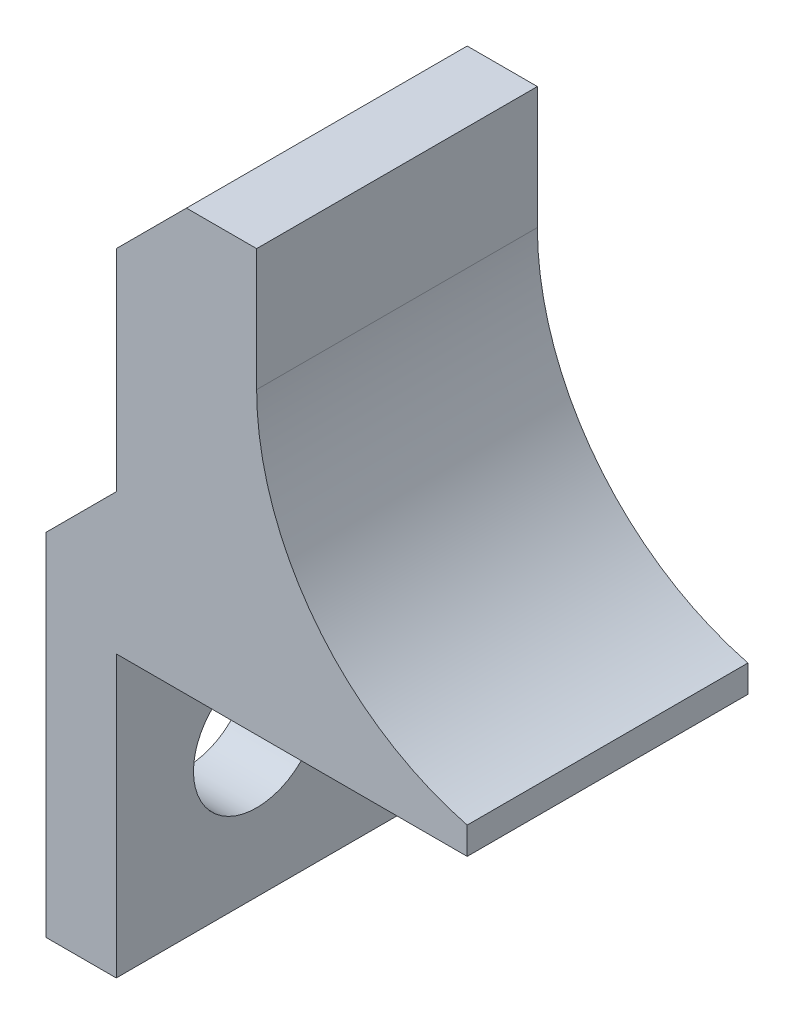
ISO-10303-21;
HEADER;
FILE_DESCRIPTION(('STEP AP214'),'2;1');
FILE_NAME('part.step','',(''),(''),'','','');
FILE_SCHEMA(('AUTOMOTIVE_DESIGN { 1 0 10303 214 1 1 1 1 }'));
ENDSEC;
DATA;
#1=APPLICATION_CONTEXT('core data for automotive mechanical design processes');
#2=APPLICATION_PROTOCOL_DEFINITION('international standard','automotive_design',2000,#1);
#3=PRODUCT_CONTEXT('',#1,'mechanical');
#4=PRODUCT('Part','Part','',(#3));
#5=PRODUCT_RELATED_PRODUCT_CATEGORY('part','',(#4));
#6=PRODUCT_DEFINITION_FORMATION('','',#4);
#7=PRODUCT_DEFINITION_CONTEXT('part definition',#1,'design');
#8=PRODUCT_DEFINITION('design','',#6,#7);
#9=PRODUCT_DEFINITION_SHAPE('','',#8);
#10=(LENGTH_UNIT() NAMED_UNIT(*) SI_UNIT(.MILLI.,.METRE.));
#11=(NAMED_UNIT(*) PLANE_ANGLE_UNIT() SI_UNIT($,.RADIAN.));
#12=(NAMED_UNIT(*) SI_UNIT($,.STERADIAN.) SOLID_ANGLE_UNIT());
#13=UNCERTAINTY_MEASURE_WITH_UNIT(LENGTH_MEASURE(1.E-05),#10,'distance_accuracy_value','');
#14=(GEOMETRIC_REPRESENTATION_CONTEXT(3) GLOBAL_UNCERTAINTY_ASSIGNED_CONTEXT((#13)) GLOBAL_UNIT_ASSIGNED_CONTEXT((#10,
#11,#12)) REPRESENTATION_CONTEXT('',''));
#15=CARTESIAN_POINT('',(0.,0.,0.));
#16=DIRECTION('',(0.,0.,1.));
#17=DIRECTION('',(1.,0.,0.));
#18=AXIS2_PLACEMENT_3D('',#15,#16,#17);
#19=CARTESIAN_POINT('',(0.,0.,20.));
#20=DIRECTION('',(-1.,0.,0.));
#21=DIRECTION('',(0.,0.,1.));
#22=AXIS2_PLACEMENT_3D('',#19,#20,#21);
#23=PLANE('',#22);
#24=CARTESIAN_POINT('',(0.,-10.,10.));
#25=DIRECTION('',(-1.,0.,0.));
#26=DIRECTION('',(0.,0.,1.));
#27=AXIS2_PLACEMENT_3D('',#24,#25,#26);
#28=CIRCLE('',#27,4.5);
#29=CARTESIAN_POINT('',(0.,-10.,14.5));
#30=VERTEX_POINT('',#29);
#31=EDGE_CURVE('E214',#30,#30,#28,.T.);
#32=ORIENTED_EDGE('',*,*,#31,.T.);
#33=EDGE_LOOP('',(#32));
#34=FACE_BOUND('',#33,.T.);
#35=DIRECTION('',(0.,1.,0.));
#36=VECTOR('',#35,1.);
#37=CARTESIAN_POINT('',(0.,0.,0.));
#38=LINE('',#37,#36);
#39=CARTESIAN_POINT('',(0.,-20.,0.));
#40=VERTEX_POINT('',#39);
#41=CARTESIAN_POINT('',(0.,0.,0.));
#42=VERTEX_POINT('',#41);
#43=EDGE_CURVE('E145',#40,#42,#38,.T.);
#44=ORIENTED_EDGE('',*,*,#43,.T.);
#45=DIRECTION('',(0.,0.,-1.));
#46=VECTOR('',#45,1.);
#47=CARTESIAN_POINT('',(0.,0.,20.));
#48=LINE('',#47,#46);
#49=CARTESIAN_POINT('',(0.,0.,20.));
#50=VERTEX_POINT('',#49);
#51=EDGE_CURVE('E126',#50,#42,#48,.T.);
#52=ORIENTED_EDGE('',*,*,#51,.F.);
#53=DIRECTION('',(0.,1.,0.));
#54=VECTOR('',#53,1.);
#55=CARTESIAN_POINT('',(0.,0.,20.));
#56=LINE('',#55,#54);
#57=CARTESIAN_POINT('',(0.,-20.,20.));
#58=VERTEX_POINT('',#57);
#59=EDGE_CURVE('E133',#58,#50,#56,.T.);
#60=ORIENTED_EDGE('',*,*,#59,.F.);
#61=DIRECTION('',(0.,0.,-1.));
#62=VECTOR('',#61,1.);
#63=CARTESIAN_POINT('',(0.,-20.,20.));
#64=LINE('',#63,#62);
#65=EDGE_CURVE('E182',#58,#40,#64,.T.);
#66=ORIENTED_EDGE('',*,*,#65,.T.);
#67=EDGE_LOOP('',(#44,#52,#60,#66));
#68=FACE_BOUND('',#67,.T.);
#69=ADVANCED_FACE('F38',(#34,#68),#23,.F.);
#70=CARTESIAN_POINT('',(6.25,0.,20.));
#71=DIRECTION('',(0.,1.,0.));
#72=DIRECTION('',(0.,0.,1.));
#73=AXIS2_PLACEMENT_3D('',#70,#71,#72);
#74=PLANE('',#73);
#75=DIRECTION('',(1.,0.,0.));
#76=VECTOR('',#75,1.);
#77=CARTESIAN_POINT('',(6.25,0.,0.));
#78=LINE('',#77,#76);
#79=CARTESIAN_POINT('',(25.,0.,0.));
#80=VERTEX_POINT('',#79);
#81=EDGE_CURVE('E209',#42,#80,#78,.T.);
#82=ORIENTED_EDGE('',*,*,#81,.T.);
#83=DIRECTION('',(0.,0.,-1.));
#84=VECTOR('',#83,1.);
#85=CARTESIAN_POINT('',(25.,0.,20.));
#86=LINE('',#85,#84);
#87=CARTESIAN_POINT('',(25.,0.,20.));
#88=VERTEX_POINT('',#87);
#89=EDGE_CURVE('E129',#88,#80,#86,.T.);
#90=ORIENTED_EDGE('',*,*,#89,.F.);
#91=DIRECTION('',(1.,0.,0.));
#92=VECTOR('',#91,1.);
#93=CARTESIAN_POINT('',(0.,0.,20.));
#94=LINE('',#93,#92);
#95=EDGE_CURVE('E122',#50,#88,#94,.T.);
#96=ORIENTED_EDGE('',*,*,#95,.F.);
#97=ORIENTED_EDGE('',*,*,#51,.T.);
#98=EDGE_LOOP('',(#82,#90,#96,#97));
#99=FACE_BOUND('',#98,.T.);
#100=ADVANCED_FACE('F124',(#99),#74,.F.);
#101=CARTESIAN_POINT('',(25.,0.,20.));
#102=DIRECTION('',(-1.,0.,0.));
#103=DIRECTION('',(0.,0.,1.));
#104=AXIS2_PLACEMENT_3D('',#101,#102,#103);
#105=PLANE('',#104);
#106=DIRECTION('',(0.,1.,0.));
#107=VECTOR('',#106,1.);
#108=CARTESIAN_POINT('',(25.,0.,0.));
#109=LINE('',#108,#107);
#110=CARTESIAN_POINT('',(25.,1.93508326896292,0.));
#111=VERTEX_POINT('',#110);
#112=EDGE_CURVE('E207',#80,#111,#109,.T.);
#113=ORIENTED_EDGE('',*,*,#112,.T.);
#114=DIRECTION('',(0.,0.,-1.));
#115=VECTOR('',#114,1.);
#116=CARTESIAN_POINT('',(25.,1.93508326896292,20.));
#117=LINE('',#116,#115);
#118=CARTESIAN_POINT('',(25.,1.93508326896292,20.));
#119=VERTEX_POINT('',#118);
#120=EDGE_CURVE('E151',#119,#111,#117,.T.);
#121=ORIENTED_EDGE('',*,*,#120,.F.);
#122=DIRECTION('',(0.,1.,0.));
#123=VECTOR('',#122,1.);
#124=CARTESIAN_POINT('',(25.,0.,20.));
#125=LINE('',#124,#123);
#126=EDGE_CURVE('E132',#88,#119,#125,.T.);
#127=ORIENTED_EDGE('',*,*,#126,.F.);
#128=ORIENTED_EDGE('',*,*,#89,.T.);
#129=EDGE_LOOP('',(#113,#121,#127,#128));
#130=FACE_BOUND('',#129,.T.);
#131=ADVANCED_FACE('F244',(#130),#105,.F.);
#132=CARTESIAN_POINT('',(30.,21.3,20.));
#133=DIRECTION('',(0.,0.,-1.));
#134=DIRECTION('',(-1.,0.,0.));
#135=AXIS2_PLACEMENT_3D('',#132,#133,#134);
#136=CYLINDRICAL_SURFACE('',#135,20.);
#137=CARTESIAN_POINT('',(30.,21.3,0.));
#138=DIRECTION('',(0.,0.,-1.));
#139=DIRECTION('',(1.,0.,0.));
#140=AXIS2_PLACEMENT_3D('',#137,#138,#139);
#141=CIRCLE('',#140,20.);
#142=CARTESIAN_POINT('',(9.99999999999999,21.3,0.));
#143=VERTEX_POINT('',#142);
#144=EDGE_CURVE('E202',#111,#143,#141,.T.);
#145=ORIENTED_EDGE('',*,*,#144,.T.);
#146=DIRECTION('',(0.,0.,-1.));
#147=VECTOR('',#146,1.);
#148=CARTESIAN_POINT('',(9.99999999999999,21.3,20.));
#149=LINE('',#148,#147);
#150=CARTESIAN_POINT('',(9.99999999999999,21.3,20.));
#151=VERTEX_POINT('',#150);
#152=EDGE_CURVE('E193',#151,#143,#149,.T.);
#153=ORIENTED_EDGE('',*,*,#152,.F.);
#154=CARTESIAN_POINT('',(30.,21.3,20.));
#155=DIRECTION('',(0.,0.,-1.));
#156=DIRECTION('',(1.,0.,0.));
#157=AXIS2_PLACEMENT_3D('',#154,#155,#156);
#158=CIRCLE('',#157,20.);
#159=EDGE_CURVE('E203',#119,#151,#158,.T.);
#160=ORIENTED_EDGE('',*,*,#159,.F.);
#161=ORIENTED_EDGE('',*,*,#120,.T.);
#162=EDGE_LOOP('',(#145,#153,#160,#161));
#163=FACE_BOUND('',#162,.T.);
#164=ADVANCED_FACE('F200',(#163),#136,.F.);
#165=CARTESIAN_POINT('',(9.99999999999999,30.,20.));
#166=DIRECTION('',(-1.,0.,0.));
#167=DIRECTION('',(0.,0.,1.));
#168=AXIS2_PLACEMENT_3D('',#165,#166,#167);
#169=PLANE('',#168);
#170=DIRECTION('',(0.,1.,0.));
#171=VECTOR('',#170,1.);
#172=CARTESIAN_POINT('',(9.99999999999999,30.,0.));
#173=LINE('',#172,#171);
#174=CARTESIAN_POINT('',(9.99999999999999,30.,0.));
#175=VERTEX_POINT('',#174);
#176=EDGE_CURVE('E177',#143,#175,#173,.T.);
#177=ORIENTED_EDGE('',*,*,#176,.T.);
#178=DIRECTION('',(0.,0.,-1.));
#179=VECTOR('',#178,1.);
#180=CARTESIAN_POINT('',(9.99999999999999,30.,20.));
#181=LINE('',#180,#179);
#182=CARTESIAN_POINT('',(9.99999999999999,30.,20.));
#183=VERTEX_POINT('',#182);
#184=EDGE_CURVE('E190',#183,#175,#181,.T.);
#185=ORIENTED_EDGE('',*,*,#184,.F.);
#186=DIRECTION('',(0.,1.,0.));
#187=VECTOR('',#186,1.);
#188=CARTESIAN_POINT('',(9.99999999999999,30.,20.));
#189=LINE('',#188,#187);
#190=EDGE_CURVE('E221',#151,#183,#189,.T.);
#191=ORIENTED_EDGE('',*,*,#190,.F.);
#192=ORIENTED_EDGE('',*,*,#152,.T.);
#193=EDGE_LOOP('',(#177,#185,#191,#192));
#194=FACE_BOUND('',#193,.T.);
#195=ADVANCED_FACE('F248',(#194),#169,.F.);
#196=CARTESIAN_POINT('',(0.,30.,20.));
#197=DIRECTION('',(0.,-1.,0.));
#198=DIRECTION('',(0.,0.,-1.));
#199=AXIS2_PLACEMENT_3D('',#196,#197,#198);
#200=PLANE('',#199);
#201=DIRECTION('',(-1.,0.,0.));
#202=VECTOR('',#201,1.);
#203=CARTESIAN_POINT('',(0.,30.,0.));
#204=LINE('',#203,#202);
#205=CARTESIAN_POINT('',(5.00000000000001,30.,0.));
#206=VERTEX_POINT('',#205);
#207=EDGE_CURVE('E174',#175,#206,#204,.T.);
#208=ORIENTED_EDGE('',*,*,#207,.T.);
#209=DIRECTION('',(0.,0.,1.));
#210=VECTOR('',#209,1.);
#211=CARTESIAN_POINT('',(5.00000000000001,30.,20.));
#212=LINE('',#211,#210);
#213=CARTESIAN_POINT('',(5.00000000000001,30.,20.));
#214=VERTEX_POINT('',#213);
#215=EDGE_CURVE('E47',#206,#214,#212,.T.);
#216=ORIENTED_EDGE('',*,*,#215,.T.);
#217=DIRECTION('',(-1.,0.,0.));
#218=VECTOR('',#217,1.);
#219=CARTESIAN_POINT('',(0.,30.,20.));
#220=LINE('',#219,#218);
#221=EDGE_CURVE('E219',#183,#214,#220,.T.);
#222=ORIENTED_EDGE('',*,*,#221,.F.);
#223=ORIENTED_EDGE('',*,*,#184,.T.);
#224=EDGE_LOOP('',(#208,#216,#222,#223));
#225=FACE_BOUND('',#224,.T.);
#226=ADVANCED_FACE('F249',(#225),#200,.F.);
#227=CARTESIAN_POINT('',(0.,5.,20.));
#228=DIRECTION('',(1.,0.,0.));
#229=DIRECTION('',(0.,0.,-1.));
#230=AXIS2_PLACEMENT_3D('',#227,#228,#229);
#231=PLANE('',#230);
#232=DIRECTION('',(0.,-1.,0.));
#233=VECTOR('',#232,1.);
#234=CARTESIAN_POINT('',(0.,5.,20.));
#235=LINE('',#234,#233);
#236=CARTESIAN_POINT('',(0.,25.,20.));
#237=VERTEX_POINT('',#236);
#238=CARTESIAN_POINT('',(0.,9.99999999999998,20.));
#239=VERTEX_POINT('',#238);
#240=EDGE_CURVE('E167',#237,#239,#235,.T.);
#241=ORIENTED_EDGE('',*,*,#240,.F.);
#242=DIRECTION('',(0.,0.,-1.));
#243=VECTOR('',#242,1.);
#244=CARTESIAN_POINT('',(0.,25.,20.));
#245=LINE('',#244,#243);
#246=CARTESIAN_POINT('',(0.,25.,0.));
#247=VERTEX_POINT('',#246);
#248=EDGE_CURVE('E159',#237,#247,#245,.T.);
#249=ORIENTED_EDGE('',*,*,#248,.T.);
#250=DIRECTION('',(0.,-1.,0.));
#251=VECTOR('',#250,1.);
#252=CARTESIAN_POINT('',(0.,5.,0.));
#253=LINE('',#252,#251);
#254=CARTESIAN_POINT('',(0.,9.99999999999998,0.));
#255=VERTEX_POINT('',#254);
#256=EDGE_CURVE('E166',#247,#255,#253,.T.);
#257=ORIENTED_EDGE('',*,*,#256,.T.);
#258=DIRECTION('',(0.,0.,1.));
#259=VECTOR('',#258,1.);
#260=CARTESIAN_POINT('',(0.,9.99999999999998,20.));
#261=LINE('',#260,#259);
#262=EDGE_CURVE('E146',#255,#239,#261,.T.);
#263=ORIENTED_EDGE('',*,*,#262,.T.);
#264=EDGE_LOOP('',(#241,#249,#257,#263));
#265=FACE_BOUND('',#264,.T.);
#266=ADVANCED_FACE('F165',(#265),#231,.F.);
#267=CARTESIAN_POINT('',(-5.,-20.,20.));
#268=DIRECTION('',(1.,0.,0.));
#269=DIRECTION('',(0.,0.,-1.));
#270=AXIS2_PLACEMENT_3D('',#267,#268,#269);
#271=PLANE('',#270);
#272=CARTESIAN_POINT('',(-5.,-10.,10.));
#273=DIRECTION('',(-1.,0.,0.));
#274=DIRECTION('',(0.,0.,1.));
#275=AXIS2_PLACEMENT_3D('',#272,#273,#274);
#276=CIRCLE('',#275,4.5);
#277=CARTESIAN_POINT('',(-5.,-10.,14.5));
#278=VERTEX_POINT('',#277);
#279=EDGE_CURVE('E227',#278,#278,#276,.T.);
#280=ORIENTED_EDGE('',*,*,#279,.F.);
#281=EDGE_LOOP('',(#280));
#282=FACE_BOUND('',#281,.T.);
#283=DIRECTION('',(0.,-1.,0.));
#284=VECTOR('',#283,1.);
#285=CARTESIAN_POINT('',(-5.,-20.,0.));
#286=LINE('',#285,#284);
#287=CARTESIAN_POINT('',(-5.,5.,0.));
#288=VERTEX_POINT('',#287);
#289=CARTESIAN_POINT('',(-5.,-20.,0.));
#290=VERTEX_POINT('',#289);
#291=EDGE_CURVE('E173',#288,#290,#286,.T.);
#292=ORIENTED_EDGE('',*,*,#291,.T.);
#293=DIRECTION('',(0.,0.,-1.));
#294=VECTOR('',#293,1.);
#295=CARTESIAN_POINT('',(-5.,-20.,20.));
#296=LINE('',#295,#294);
#297=CARTESIAN_POINT('',(-5.,-20.,20.));
#298=VERTEX_POINT('',#297);
#299=EDGE_CURVE('E184',#298,#290,#296,.T.);
#300=ORIENTED_EDGE('',*,*,#299,.F.);
#301=DIRECTION('',(0.,-1.,0.));
#302=VECTOR('',#301,1.);
#303=CARTESIAN_POINT('',(-5.,-20.,20.));
#304=LINE('',#303,#302);
#305=CARTESIAN_POINT('',(-5.,5.,20.));
#306=VERTEX_POINT('',#305);
#307=EDGE_CURVE('E216',#306,#298,#304,.T.);
#308=ORIENTED_EDGE('',*,*,#307,.F.);
#309=DIRECTION('',(0.,0.,-1.));
#310=VECTOR('',#309,1.);
#311=CARTESIAN_POINT('',(-5.,5.,20.));
#312=LINE('',#311,#310);
#313=EDGE_CURVE('E187',#306,#288,#312,.T.);
#314=ORIENTED_EDGE('',*,*,#313,.T.);
#315=EDGE_LOOP('',(#292,#300,#308,#314));
#316=FACE_BOUND('',#315,.T.);
#317=ADVANCED_FACE('F234',(#282,#316),#271,.F.);
#318=CARTESIAN_POINT('',(0.,-20.,20.));
#319=DIRECTION('',(0.,1.,0.));
#320=DIRECTION('',(0.,0.,1.));
#321=AXIS2_PLACEMENT_3D('',#318,#319,#320);
#322=PLANE('',#321);
#323=DIRECTION('',(1.,0.,0.));
#324=VECTOR('',#323,1.);
#325=CARTESIAN_POINT('',(0.,-20.,0.));
#326=LINE('',#325,#324);
#327=EDGE_CURVE('E142',#290,#40,#326,.T.);
#328=ORIENTED_EDGE('',*,*,#327,.T.);
#329=ORIENTED_EDGE('',*,*,#65,.F.);
#330=DIRECTION('',(1.,0.,0.));
#331=VECTOR('',#330,1.);
#332=CARTESIAN_POINT('',(0.,-20.,20.));
#333=LINE('',#332,#331);
#334=EDGE_CURVE('E138',#298,#58,#333,.T.);
#335=ORIENTED_EDGE('',*,*,#334,.F.);
#336=ORIENTED_EDGE('',*,*,#299,.T.);
#337=EDGE_LOOP('',(#328,#329,#335,#336));
#338=FACE_BOUND('',#337,.T.);
#339=ADVANCED_FACE('F237',(#338),#322,.F.);
#340=CARTESIAN_POINT('',(30.,21.3,20.));
#341=DIRECTION('',(0.,0.,1.));
#342=DIRECTION('',(1.,0.,0.));
#343=AXIS2_PLACEMENT_3D('',#340,#341,#342);
#344=PLANE('',#343);
#345=ORIENTED_EDGE('',*,*,#221,.T.);
#346=DIRECTION('',(0.707106781186549,0.707106781186547,0.));
#347=VECTOR('',#346,1.);
#348=CARTESIAN_POINT('',(13.15,38.15,20.));
#349=LINE('',#348,#347);
#350=EDGE_CURVE('E11',#214,#237,#349,.F.);
#351=ORIENTED_EDGE('',*,*,#350,.T.);
#352=ORIENTED_EDGE('',*,*,#240,.T.);
#353=DIRECTION('',(0.707106781186549,0.707106781186546,0.));
#354=VECTOR('',#353,1.);
#355=CARTESIAN_POINT('',(-5.,5.,20.));
#356=LINE('',#355,#354);
#357=EDGE_CURVE('E157',#239,#306,#356,.F.);
#358=ORIENTED_EDGE('',*,*,#357,.T.);
#359=ORIENTED_EDGE('',*,*,#307,.T.);
#360=ORIENTED_EDGE('',*,*,#334,.T.);
#361=ORIENTED_EDGE('',*,*,#59,.T.);
#362=ORIENTED_EDGE('',*,*,#95,.T.);
#363=ORIENTED_EDGE('',*,*,#126,.T.);
#364=ORIENTED_EDGE('',*,*,#159,.T.);
#365=ORIENTED_EDGE('',*,*,#190,.T.);
#366=EDGE_LOOP('',(#345,#351,#352,#358,#359,#360,#361,#362,#363,#364,#365));
#367=FACE_BOUND('',#366,.T.);
#368=ADVANCED_FACE('F136',(#367),#344,.T.);
#369=CARTESIAN_POINT('',(30.,21.3,0.));
#370=DIRECTION('',(0.,0.,1.));
#371=DIRECTION('',(1.,0.,0.));
#372=AXIS2_PLACEMENT_3D('',#369,#370,#371);
#373=PLANE('',#372);
#374=ORIENTED_EDGE('',*,*,#256,.F.);
#375=DIRECTION('',(-0.707106781186549,-0.707106781186547,0.));
#376=VECTOR('',#375,1.);
#377=CARTESIAN_POINT('',(0.,25.,0.));
#378=LINE('',#377,#376);
#379=EDGE_CURVE('E61',#247,#206,#378,.F.);
#380=ORIENTED_EDGE('',*,*,#379,.T.);
#381=ORIENTED_EDGE('',*,*,#207,.F.);
#382=ORIENTED_EDGE('',*,*,#176,.F.);
#383=ORIENTED_EDGE('',*,*,#144,.F.);
#384=ORIENTED_EDGE('',*,*,#112,.F.);
#385=ORIENTED_EDGE('',*,*,#81,.F.);
#386=ORIENTED_EDGE('',*,*,#43,.F.);
#387=ORIENTED_EDGE('',*,*,#327,.F.);
#388=ORIENTED_EDGE('',*,*,#291,.F.);
#389=DIRECTION('',(-0.707106781186549,-0.707106781186546,0.));
#390=VECTOR('',#389,1.);
#391=CARTESIAN_POINT('',(20.6500000000001,30.65,0.));
#392=LINE('',#391,#390);
#393=EDGE_CURVE('E149',#288,#255,#392,.F.);
#394=ORIENTED_EDGE('',*,*,#393,.T.);
#395=EDGE_LOOP('',(#374,#380,#381,#382,#383,#384,#385,#386,#387,#388,#394));
#396=FACE_BOUND('',#395,.T.);
#397=ADVANCED_FACE('F170',(#396),#373,.F.);
#398=CARTESIAN_POINT('',(15.,-10.,10.));
#399=DIRECTION('',(-1.,0.,0.));
#400=DIRECTION('',(0.,0.,1.));
#401=AXIS2_PLACEMENT_3D('',#398,#399,#400);
#402=CYLINDRICAL_SURFACE('',#401,4.5);
#403=ORIENTED_EDGE('',*,*,#279,.T.);
#404=EDGE_LOOP('',(#403));
#405=FACE_BOUND('',#404,.T.);
#406=ORIENTED_EDGE('',*,*,#31,.F.);
#407=EDGE_LOOP('',(#406));
#408=FACE_BOUND('',#407,.T.);
#409=ADVANCED_FACE('F231',(#405,#408),#402,.F.);
#410=CARTESIAN_POINT('',(-5.,5.,20.));
#411=DIRECTION('',(-0.707106781186546,0.707106781186549,0.));
#412=DIRECTION('',(0.,0.,1.));
#413=AXIS2_PLACEMENT_3D('',#410,#411,#412);
#414=PLANE('',#413);
#415=ORIENTED_EDGE('',*,*,#357,.F.);
#416=ORIENTED_EDGE('',*,*,#262,.F.);
#417=ORIENTED_EDGE('',*,*,#393,.F.);
#418=ORIENTED_EDGE('',*,*,#313,.F.);
#419=EDGE_LOOP('',(#415,#416,#417,#418));
#420=FACE_BOUND('',#419,.T.);
#421=ADVANCED_FACE('F251',(#420),#414,.T.);
#422=CARTESIAN_POINT('',(0.,25.,20.));
#423=DIRECTION('',(0.707106781186546,-0.707106781186548,0.));
#424=DIRECTION('',(0.,0.,-1.));
#425=AXIS2_PLACEMENT_3D('',#422,#423,#424);
#426=PLANE('',#425);
#427=ORIENTED_EDGE('',*,*,#350,.F.);
#428=ORIENTED_EDGE('',*,*,#215,.F.);
#429=ORIENTED_EDGE('',*,*,#379,.F.);
#430=ORIENTED_EDGE('',*,*,#248,.F.);
#431=EDGE_LOOP('',(#427,#428,#429,#430));
#432=FACE_BOUND('',#431,.T.);
#433=ADVANCED_FACE('F41',(#432),#426,.F.);
#434=CLOSED_SHELL('',(#69,#100,#131,#164,#195,#226,#266,#317,#339,#368,#397,#409,#421,#433));
#435=MANIFOLD_SOLID_BREP('B2',#434);
#436=ADVANCED_BREP_SHAPE_REPRESENTATION('',(#18,#435),#14);
#437=SHAPE_DEFINITION_REPRESENTATION(#9,#436);
ENDSEC;
END-ISO-10303-21;
